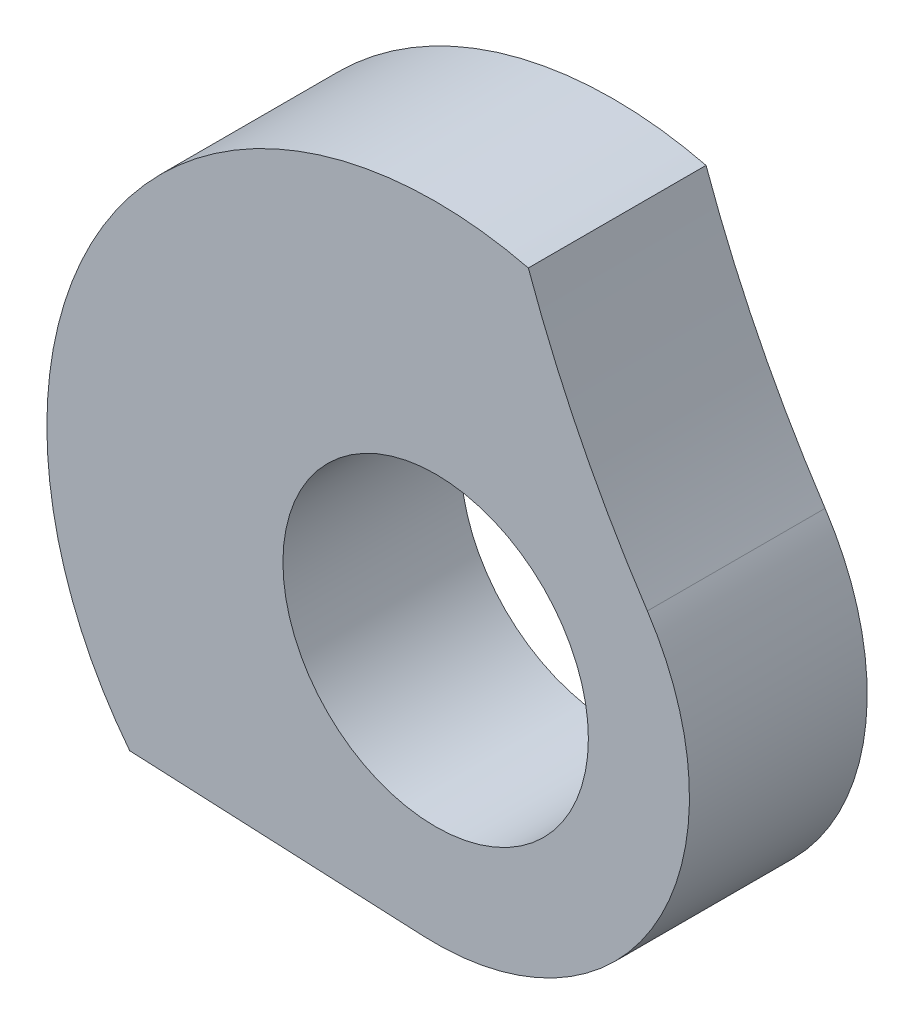
ISO-10303-21;
HEADER;
FILE_DESCRIPTION(('STEP AP214'),'2;1');
FILE_NAME('part.step','',(''),(''),'','','');
FILE_SCHEMA(('AUTOMOTIVE_DESIGN { 1 0 10303 214 1 1 1 1 }'));
ENDSEC;
DATA;
#1=APPLICATION_CONTEXT('core data for automotive mechanical design processes');
#2=APPLICATION_PROTOCOL_DEFINITION('international standard','automotive_design',2000,#1);
#3=PRODUCT_CONTEXT('',#1,'mechanical');
#4=PRODUCT('Part','Part','',(#3));
#5=PRODUCT_RELATED_PRODUCT_CATEGORY('part','',(#4));
#6=PRODUCT_DEFINITION_FORMATION('','',#4);
#7=PRODUCT_DEFINITION_CONTEXT('part definition',#1,'design');
#8=PRODUCT_DEFINITION('design','',#6,#7);
#9=PRODUCT_DEFINITION_SHAPE('','',#8);
#10=(LENGTH_UNIT() NAMED_UNIT(*) SI_UNIT(.MILLI.,.METRE.));
#11=(NAMED_UNIT(*) PLANE_ANGLE_UNIT() SI_UNIT($,.RADIAN.));
#12=(NAMED_UNIT(*) SI_UNIT($,.STERADIAN.) SOLID_ANGLE_UNIT());
#13=UNCERTAINTY_MEASURE_WITH_UNIT(LENGTH_MEASURE(1.E-05),#10,'distance_accuracy_value','');
#14=(GEOMETRIC_REPRESENTATION_CONTEXT(3) GLOBAL_UNCERTAINTY_ASSIGNED_CONTEXT((#13)) GLOBAL_UNIT_ASSIGNED_CONTEXT((#10,
#11,#12)) REPRESENTATION_CONTEXT('',''));
#15=CARTESIAN_POINT('',(0.,0.,0.));
#16=DIRECTION('',(0.,0.,1.));
#17=DIRECTION('',(1.,0.,0.));
#18=AXIS2_PLACEMENT_3D('',#15,#16,#17);
#19=CARTESIAN_POINT('',(26.67,-18.1463402370836,4.064));
#20=DIRECTION('',(0.,0.,-1.));
#21=DIRECTION('',(0.,1.,0.));
#22=AXIS2_PLACEMENT_3D('',#19,#20,#21);
#23=CYLINDRICAL_SURFACE('',#22,8.89);
#24=DIRECTION('',(0.,0.,-1.));
#25=VECTOR('',#24,1.);
#26=CARTESIAN_POINT('',(19.6740421105671,-23.6316545589144,4.064));
#27=LINE('',#26,#25);
#28=CARTESIAN_POINT('',(19.6740421105671,-23.6316545589144,4.064));
#29=VERTEX_POINT('',#28);
#30=CARTESIAN_POINT('',(19.6740421105671,-23.6316545589144,0.));
#31=VERTEX_POINT('',#30);
#32=EDGE_CURVE('E89',#29,#31,#27,.T.);
#33=ORIENTED_EDGE('',*,*,#32,.F.);
#34=CARTESIAN_POINT('',(26.67,-18.1463402370836,4.064));
#35=DIRECTION('',(0.,0.,-1.));
#36=DIRECTION('',(-1.,0.,0.));
#37=AXIS2_PLACEMENT_3D('',#34,#35,#36);
#38=CIRCLE('',#37,8.89);
#39=CARTESIAN_POINT('',(28.7895874131662,-9.5127170580268,4.064));
#40=VERTEX_POINT('',#39);
#41=EDGE_CURVE('E11',#40,#29,#38,.F.);
#42=ORIENTED_EDGE('',*,*,#41,.F.);
#43=DIRECTION('',(0.,0.,-1.));
#44=VECTOR('',#43,1.);
#45=CARTESIAN_POINT('',(28.7895874131662,-9.51271705802679,2.03199999999999));
#46=LINE('',#45,#44);
#47=CARTESIAN_POINT('',(28.7895874131662,-9.51271705802681,0.));
#48=VERTEX_POINT('',#47);
#49=EDGE_CURVE('E91',#48,#40,#46,.F.);
#50=ORIENTED_EDGE('',*,*,#49,.F.);
#51=CARTESIAN_POINT('',(26.67,-18.1463402370836,0.));
#52=DIRECTION('',(0.,0.,1.));
#53=DIRECTION('',(1.,0.,0.));
#54=AXIS2_PLACEMENT_3D('',#51,#52,#53);
#55=CIRCLE('',#54,8.89);
#56=EDGE_CURVE('E85',#31,#48,#55,.F.);
#57=ORIENTED_EDGE('',*,*,#56,.F.);
#58=EDGE_LOOP('',(#33,#42,#50,#57));
#59=FACE_BOUND('',#58,.T.);
#60=ADVANCED_FACE('F40',(#59),#23,.T.);
#61=CARTESIAN_POINT('',(10.9562814285125,32.2243571426838,0.));
#62=DIRECTION('',(0.,0.,1.));
#63=DIRECTION('',(1.,0.,0.));
#64=AXIS2_PLACEMENT_3D('',#61,#62,#63);
#65=PLANE('',#64);
#66=CARTESIAN_POINT('',(26.67,-18.1463402370836,0.));
#67=DIRECTION('',(0.,0.,-1.));
#68=DIRECTION('',(-1.,0.,0.));
#69=AXIS2_PLACEMENT_3D('',#66,#67,#68);
#70=CIRCLE('',#69,3.4925);
#71=CARTESIAN_POINT('',(23.1775,-18.1463402370836,0.));
#72=VERTEX_POINT('',#71);
#73=EDGE_CURVE('E92',#72,#72,#70,.T.);
#74=ORIENTED_EDGE('',*,*,#73,.F.);
#75=EDGE_LOOP('',(#74));
#76=FACE_BOUND('',#75,.T.);
#77=DIRECTION('',(0.99892375809187,-0.0463823837207166,0.));
#78=VECTOR('',#77,1.);
#79=CARTESIAN_POINT('',(18.7890022464633,-23.5905600727212,0.));
#80=LINE('',#79,#78);
#81=CARTESIAN_POINT('',(26.4008012831233,-23.943993836673,0.));
#82=VERTEX_POINT('',#81);
#83=EDGE_CURVE('E44',#31,#82,#80,.T.);
#84=ORIENTED_EDGE('',*,*,#83,.F.);
#85=ORIENTED_EDGE('',*,*,#56,.T.);
#86=CARTESIAN_POINT('',(52.6967377381278,-0.933197063313348,0.));
#87=DIRECTION('',(0.,0.,-1.));
#88=DIRECTION('',(-1.,0.,0.));
#89=AXIS2_PLACEMENT_3D('',#86,#87,#88);
#90=CIRCLE('',#89,25.4);
#91=CARTESIAN_POINT('',(31.5109520335061,-14.9447096182749,0.));
#92=VERTEX_POINT('',#91);
#93=EDGE_CURVE('E110',#92,#48,#90,.T.);
#94=ORIENTED_EDGE('',*,*,#93,.F.);
#95=CARTESIAN_POINT('',(26.67,-18.1463402370836,0.));
#96=DIRECTION('',(0.,0.,-1.));
#97=DIRECTION('',(-1.,0.,0.));
#98=AXIS2_PLACEMENT_3D('',#95,#96,#97);
#99=CIRCLE('',#98,5.80389999999999);
#100=EDGE_CURVE('E102',#82,#92,#99,.F.);
#101=ORIENTED_EDGE('',*,*,#100,.F.);
#102=EDGE_LOOP('',(#84,#85,#94,#101));
#103=FACE_BOUND('',#102,.T.);
#104=ADVANCED_FACE('F42',(#76,#103),#65,.F.);
#105=CARTESIAN_POINT('',(52.6967377381278,-0.933197063313348,4.064));
#106=DIRECTION('',(0.,0.,-1.));
#107=DIRECTION('',(-1.,0.,0.));
#108=AXIS2_PLACEMENT_3D('',#105,#106,#107);
#109=CYLINDRICAL_SURFACE('',#108,25.4);
#110=ORIENTED_EDGE('',*,*,#93,.T.);
#111=ORIENTED_EDGE('',*,*,#49,.T.);
#112=CARTESIAN_POINT('',(52.6967377381278,-0.933197063313348,4.064));
#113=DIRECTION('',(0.,0.,-1.));
#114=DIRECTION('',(-1.,0.,0.));
#115=AXIS2_PLACEMENT_3D('',#112,#113,#114);
#116=CIRCLE('',#115,25.4);
#117=CARTESIAN_POINT('',(31.5109520335061,-14.9447096182749,4.064));
#118=VERTEX_POINT('',#117);
#119=EDGE_CURVE('E108',#118,#40,#116,.T.);
#120=ORIENTED_EDGE('',*,*,#119,.F.);
#121=DIRECTION('',(0.,0.,-1.));
#122=VECTOR('',#121,1.);
#123=CARTESIAN_POINT('',(31.5109520335061,-14.9447096182749,4.064));
#124=LINE('',#123,#122);
#125=EDGE_CURVE('E77',#92,#118,#124,.F.);
#126=ORIENTED_EDGE('',*,*,#125,.F.);
#127=EDGE_LOOP('',(#110,#111,#120,#126));
#128=FACE_BOUND('',#127,.T.);
#129=ADVANCED_FACE('F133',(#128),#109,.F.);
#130=CARTESIAN_POINT('',(26.67,-18.1463402370836,4.064));
#131=DIRECTION('',(0.,0.,-1.));
#132=DIRECTION('',(-1.,0.,0.));
#133=AXIS2_PLACEMENT_3D('',#130,#131,#132);
#134=CYLINDRICAL_SURFACE('',#133,5.80389999999999);
#135=CARTESIAN_POINT('',(26.67,-18.1463402370836,4.064));
#136=DIRECTION('',(0.,0.,-1.));
#137=DIRECTION('',(-1.,0.,0.));
#138=AXIS2_PLACEMENT_3D('',#135,#136,#137);
#139=CIRCLE('',#138,5.80389999999999);
#140=CARTESIAN_POINT('',(26.4008012831233,-23.943993836673,4.064));
#141=VERTEX_POINT('',#140);
#142=EDGE_CURVE('E122',#118,#141,#139,.T.);
#143=ORIENTED_EDGE('',*,*,#142,.T.);
#144=DIRECTION('',(0.,0.,-1.));
#145=VECTOR('',#144,1.);
#146=CARTESIAN_POINT('',(26.4008012831233,-23.943993836673,4.064));
#147=LINE('',#146,#145);
#148=EDGE_CURVE('E123',#141,#82,#147,.T.);
#149=ORIENTED_EDGE('',*,*,#148,.T.);
#150=ORIENTED_EDGE('',*,*,#100,.T.);
#151=ORIENTED_EDGE('',*,*,#125,.T.);
#152=EDGE_LOOP('',(#143,#149,#150,#151));
#153=FACE_BOUND('',#152,.T.);
#154=ADVANCED_FACE('F135',(#153),#134,.T.);
#155=CARTESIAN_POINT('',(10.9562814285125,32.2243571426838,4.064));
#156=DIRECTION('',(0.,0.,1.));
#157=DIRECTION('',(1.,0.,0.));
#158=AXIS2_PLACEMENT_3D('',#155,#156,#157);
#159=PLANE('',#158);
#160=DIRECTION('',(-0.99892375809187,0.0463823837207161,0.));
#161=VECTOR('',#160,1.);
#162=CARTESIAN_POINT('',(18.7890022464633,-23.5905600727212,4.064));
#163=LINE('',#162,#161);
#164=EDGE_CURVE('E51',#29,#141,#163,.F.);
#165=ORIENTED_EDGE('',*,*,#164,.T.);
#166=ORIENTED_EDGE('',*,*,#142,.F.);
#167=ORIENTED_EDGE('',*,*,#119,.T.);
#168=ORIENTED_EDGE('',*,*,#41,.T.);
#169=EDGE_LOOP('',(#165,#166,#167,#168));
#170=FACE_BOUND('',#169,.T.);
#171=CARTESIAN_POINT('',(26.67,-18.1463402370836,4.064));
#172=DIRECTION('',(0.,0.,-1.));
#173=DIRECTION('',(-1.,0.,0.));
#174=AXIS2_PLACEMENT_3D('',#171,#172,#173);
#175=CIRCLE('',#174,3.4925);
#176=CARTESIAN_POINT('',(23.1775,-18.1463402370836,4.064));
#177=VERTEX_POINT('',#176);
#178=EDGE_CURVE('E104',#177,#177,#175,.T.);
#179=ORIENTED_EDGE('',*,*,#178,.T.);
#180=EDGE_LOOP('',(#179));
#181=FACE_BOUND('',#180,.T.);
#182=ADVANCED_FACE('F141',(#170,#181),#159,.T.);
#183=CARTESIAN_POINT('',(18.7890022464633,-23.5905600727212,4.064));
#184=DIRECTION('',(0.0463823837207161,0.99892375809187,0.));
#185=DIRECTION('',(-0.99892375809187,0.0463823837207161,0.));
#186=AXIS2_PLACEMENT_3D('',#183,#184,#185);
#187=PLANE('',#186);
#188=ORIENTED_EDGE('',*,*,#164,.F.);
#189=ORIENTED_EDGE('',*,*,#32,.T.);
#190=ORIENTED_EDGE('',*,*,#83,.T.);
#191=ORIENTED_EDGE('',*,*,#148,.F.);
#192=EDGE_LOOP('',(#188,#189,#190,#191));
#193=FACE_BOUND('',#192,.T.);
#194=ADVANCED_FACE('F95',(#193),#187,.F.);
#195=CARTESIAN_POINT('',(26.67,-18.1463402370836,4.064));
#196=DIRECTION('',(0.,0.,-1.));
#197=DIRECTION('',(-1.,0.,0.));
#198=AXIS2_PLACEMENT_3D('',#195,#196,#197);
#199=CYLINDRICAL_SURFACE('',#198,3.4925);
#200=ORIENTED_EDGE('',*,*,#178,.F.);
#201=EDGE_LOOP('',(#200));
#202=FACE_BOUND('',#201,.T.);
#203=ORIENTED_EDGE('',*,*,#73,.T.);
#204=EDGE_LOOP('',(#203));
#205=FACE_BOUND('',#204,.T.);
#206=ADVANCED_FACE('F153',(#202,#205),#199,.F.);
#207=CLOSED_SHELL('',(#60,#104,#129,#154,#182,#194,#206));
#208=MANIFOLD_SOLID_BREP('B2',#207);
#209=ADVANCED_BREP_SHAPE_REPRESENTATION('',(#18,#208),#14);
#210=SHAPE_DEFINITION_REPRESENTATION(#9,#209);
ENDSEC;
END-ISO-10303-21;
